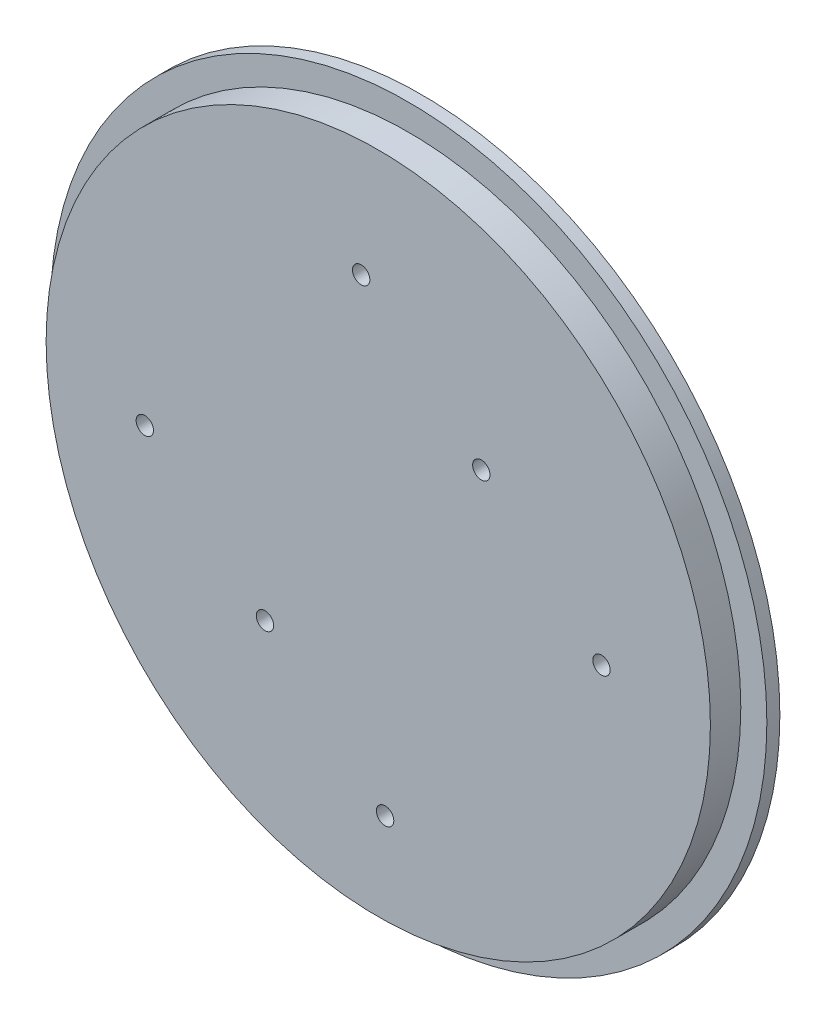
ISO-10303-21;
HEADER;
FILE_DESCRIPTION(('STEP AP214'),'2;1');
FILE_NAME('part.step','',(''),(''),'','','');
FILE_SCHEMA(('AUTOMOTIVE_DESIGN { 1 0 10303 214 1 1 1 1 }'));
ENDSEC;
DATA;
#1=APPLICATION_CONTEXT('core data for automotive mechanical design processes');
#2=APPLICATION_PROTOCOL_DEFINITION('international standard','automotive_design',2000,#1);
#3=PRODUCT_CONTEXT('',#1,'mechanical');
#4=PRODUCT('Part','Part','',(#3));
#5=PRODUCT_RELATED_PRODUCT_CATEGORY('part','',(#4));
#6=PRODUCT_DEFINITION_FORMATION('','',#4);
#7=PRODUCT_DEFINITION_CONTEXT('part definition',#1,'design');
#8=PRODUCT_DEFINITION('design','',#6,#7);
#9=PRODUCT_DEFINITION_SHAPE('','',#8);
#10=(LENGTH_UNIT() NAMED_UNIT(*) SI_UNIT(.MILLI.,.METRE.));
#11=(NAMED_UNIT(*) PLANE_ANGLE_UNIT() SI_UNIT($,.RADIAN.));
#12=(NAMED_UNIT(*) SI_UNIT($,.STERADIAN.) SOLID_ANGLE_UNIT());
#13=UNCERTAINTY_MEASURE_WITH_UNIT(LENGTH_MEASURE(1.E-05),#10,'distance_accuracy_value','');
#14=(GEOMETRIC_REPRESENTATION_CONTEXT(3) GLOBAL_UNCERTAINTY_ASSIGNED_CONTEXT((#13)) GLOBAL_UNIT_ASSIGNED_CONTEXT((#10,
#11,#12)) REPRESENTATION_CONTEXT('',''));
#15=CARTESIAN_POINT('',(0.,0.,0.));
#16=DIRECTION('',(0.,0.,1.));
#17=DIRECTION('',(1.,0.,0.));
#18=AXIS2_PLACEMENT_3D('',#15,#16,#17);
#19=CARTESIAN_POINT('',(-3.93578105345823,49.5924455360115,10.));
#20=DIRECTION('',(0.,0.,-1.));
#21=DIRECTION('',(-1.,0.,0.));
#22=AXIS2_PLACEMENT_3D('',#19,#20,#21);
#23=CYLINDRICAL_SURFACE('',#22,2.);
#24=CARTESIAN_POINT('',(-3.93578105345823,49.5924455360115,10.));
#25=DIRECTION('',(0.,0.,-1.));
#26=DIRECTION('',(-1.,0.,0.));
#27=AXIS2_PLACEMENT_3D('',#24,#25,#26);
#28=CIRCLE('',#27,2.);
#29=CARTESIAN_POINT('',(-5.93578105345822,49.5924455360115,10.));
#30=VERTEX_POINT('',#29);
#31=EDGE_CURVE('E128',#30,#30,#28,.T.);
#32=ORIENTED_EDGE('',*,*,#31,.F.);
#33=EDGE_LOOP('',(#32));
#34=FACE_BOUND('',#33,.T.);
#35=CARTESIAN_POINT('',(-3.93578105345823,49.5924455360115,5.));
#36=DIRECTION('',(0.,0.,-1.));
#37=DIRECTION('',(-1.,0.,0.));
#38=AXIS2_PLACEMENT_3D('',#35,#36,#37);
#39=CIRCLE('',#38,2.);
#40=CARTESIAN_POINT('',(-5.93578105345822,49.5924455360115,5.));
#41=VERTEX_POINT('',#40);
#42=EDGE_CURVE('E45',#41,#41,#39,.F.);
#43=ORIENTED_EDGE('',*,*,#42,.F.);
#44=EDGE_LOOP('',(#43));
#45=FACE_BOUND('',#44,.T.);
#46=ADVANCED_FACE('F41',(#34,#45),#23,.F.);
#47=CARTESIAN_POINT('',(23.7357315299309,24.5063958002057,10.));
#48=DIRECTION('',(0.,0.,-1.));
#49=DIRECTION('',(-1.,0.,0.));
#50=AXIS2_PLACEMENT_3D('',#47,#48,#49);
#51=CYLINDRICAL_SURFACE('',#50,2.);
#52=CARTESIAN_POINT('',(23.7357315299309,24.5063958002057,10.));
#53=DIRECTION('',(0.,0.,-1.));
#54=DIRECTION('',(-1.,0.,0.));
#55=AXIS2_PLACEMENT_3D('',#52,#53,#54);
#56=CIRCLE('',#55,2.);
#57=CARTESIAN_POINT('',(21.7357315299309,24.5063958002057,10.));
#58=VERTEX_POINT('',#57);
#59=EDGE_CURVE('E133',#58,#58,#56,.T.);
#60=ORIENTED_EDGE('',*,*,#59,.F.);
#61=EDGE_LOOP('',(#60));
#62=FACE_BOUND('',#61,.T.);
#63=CARTESIAN_POINT('',(23.7357315299309,24.5063958002057,5.));
#64=DIRECTION('',(0.,0.,-1.));
#65=DIRECTION('',(-1.,0.,0.));
#66=AXIS2_PLACEMENT_3D('',#63,#64,#65);
#67=CIRCLE('',#66,2.);
#68=CARTESIAN_POINT('',(21.7357315299309,24.5063958002057,5.));
#69=VERTEX_POINT('',#68);
#70=EDGE_CURVE('E121',#69,#69,#67,.F.);
#71=ORIENTED_EDGE('',*,*,#70,.F.);
#72=EDGE_LOOP('',(#71));
#73=FACE_BOUND('',#72,.T.);
#74=ADVANCED_FACE('F249',(#62,#73),#51,.F.);
#75=CARTESIAN_POINT('',(51.4072441133201,-0.579653935599934,10.));
#76=DIRECTION('',(0.,0.,-1.));
#77=DIRECTION('',(-1.,0.,0.));
#78=AXIS2_PLACEMENT_3D('',#75,#76,#77);
#79=CYLINDRICAL_SURFACE('',#78,2.);
#80=CARTESIAN_POINT('',(51.4072441133201,-0.579653935599934,10.));
#81=DIRECTION('',(0.,0.,-1.));
#82=DIRECTION('',(-1.,0.,0.));
#83=AXIS2_PLACEMENT_3D('',#80,#81,#82);
#84=CIRCLE('',#83,2.);
#85=CARTESIAN_POINT('',(49.4072441133201,-0.579653935599934,10.));
#86=VERTEX_POINT('',#85);
#87=EDGE_CURVE('E138',#86,#86,#84,.T.);
#88=ORIENTED_EDGE('',*,*,#87,.F.);
#89=EDGE_LOOP('',(#88));
#90=FACE_BOUND('',#89,.T.);
#91=CARTESIAN_POINT('',(51.4072441133201,-0.579653935599934,5.));
#92=DIRECTION('',(0.,0.,-1.));
#93=DIRECTION('',(-1.,0.,0.));
#94=AXIS2_PLACEMENT_3D('',#91,#92,#93);
#95=CIRCLE('',#94,2.);
#96=CARTESIAN_POINT('',(49.4072441133201,-0.579653935599934,5.));
#97=VERTEX_POINT('',#96);
#98=EDGE_CURVE('E118',#97,#97,#95,.F.);
#99=ORIENTED_EDGE('',*,*,#98,.F.);
#100=EDGE_LOOP('',(#99));
#101=FACE_BOUND('',#100,.T.);
#102=ADVANCED_FACE('F255',(#90,#101),#79,.F.);
#103=CARTESIAN_POINT('',(-53.7695311495795,-5.37735869324198,10.));
#104=DIRECTION('',(0.,0.,-1.));
#105=DIRECTION('',(-1.,0.,0.));
#106=AXIS2_PLACEMENT_3D('',#103,#104,#105);
#107=CYLINDRICAL_SURFACE('',#106,2.);
#108=CARTESIAN_POINT('',(-53.7695311495795,-5.37735869324198,10.));
#109=DIRECTION('',(0.,0.,-1.));
#110=DIRECTION('',(-1.,0.,0.));
#111=AXIS2_PLACEMENT_3D('',#108,#109,#110);
#112=CIRCLE('',#111,2.);
#113=CARTESIAN_POINT('',(-55.7695311495795,-5.37735869324198,10.));
#114=VERTEX_POINT('',#113);
#115=EDGE_CURVE('E144',#114,#114,#112,.T.);
#116=ORIENTED_EDGE('',*,*,#115,.F.);
#117=EDGE_LOOP('',(#116));
#118=FACE_BOUND('',#117,.T.);
#119=CARTESIAN_POINT('',(-53.7695311495795,-5.37735869324198,5.));
#120=DIRECTION('',(0.,0.,-1.));
#121=DIRECTION('',(-1.,0.,0.));
#122=AXIS2_PLACEMENT_3D('',#119,#120,#121);
#123=CIRCLE('',#122,2.);
#124=CARTESIAN_POINT('',(-55.7695311495795,-5.37735869324198,5.));
#125=VERTEX_POINT('',#124);
#126=EDGE_CURVE('E114',#125,#125,#123,.F.);
#127=ORIENTED_EDGE('',*,*,#126,.F.);
#128=EDGE_LOOP('',(#127));
#129=FACE_BOUND('',#128,.T.);
#130=ADVANCED_FACE('F318',(#118,#129),#107,.F.);
#131=CARTESIAN_POINT('',(-26.0980185661855,-30.4634084290424,10.));
#132=DIRECTION('',(0.,0.,-1.));
#133=DIRECTION('',(-1.,0.,0.));
#134=AXIS2_PLACEMENT_3D('',#131,#132,#133);
#135=CYLINDRICAL_SURFACE('',#134,2.);
#136=CARTESIAN_POINT('',(-26.0980185661855,-30.4634084290424,10.));
#137=DIRECTION('',(0.,0.,-1.));
#138=DIRECTION('',(-1.,0.,0.));
#139=AXIS2_PLACEMENT_3D('',#136,#137,#138);
#140=CIRCLE('',#139,2.);
#141=CARTESIAN_POINT('',(-28.0980185661855,-30.4634084290424,10.));
#142=VERTEX_POINT('',#141);
#143=EDGE_CURVE('E148',#142,#142,#140,.T.);
#144=ORIENTED_EDGE('',*,*,#143,.F.);
#145=EDGE_LOOP('',(#144));
#146=FACE_BOUND('',#145,.T.);
#147=CARTESIAN_POINT('',(-26.0980185661855,-30.4634084290424,5.));
#148=DIRECTION('',(0.,0.,-1.));
#149=DIRECTION('',(-1.,0.,0.));
#150=AXIS2_PLACEMENT_3D('',#147,#148,#149);
#151=CIRCLE('',#150,2.);
#152=CARTESIAN_POINT('',(-28.0980185661855,-30.4634084290424,5.));
#153=VERTEX_POINT('',#152);
#154=EDGE_CURVE('E109',#153,#153,#151,.F.);
#155=ORIENTED_EDGE('',*,*,#154,.F.);
#156=EDGE_LOOP('',(#155));
#157=FACE_BOUND('',#156,.T.);
#158=ADVANCED_FACE('F311',(#146,#157),#135,.F.);
#159=CARTESIAN_POINT('',(1.57349401720842,-55.5494581648429,10.));
#160=DIRECTION('',(0.,0.,-1.));
#161=DIRECTION('',(-1.,0.,0.));
#162=AXIS2_PLACEMENT_3D('',#159,#160,#161);
#163=CYLINDRICAL_SURFACE('',#162,2.);
#164=CARTESIAN_POINT('',(1.57349401720842,-55.5494581648429,10.));
#165=DIRECTION('',(0.,0.,-1.));
#166=DIRECTION('',(-1.,0.,0.));
#167=AXIS2_PLACEMENT_3D('',#164,#165,#166);
#168=CIRCLE('',#167,2.);
#169=CARTESIAN_POINT('',(-0.426505982791577,-55.5494581648429,10.));
#170=VERTEX_POINT('',#169);
#171=EDGE_CURVE('E152',#170,#170,#168,.T.);
#172=ORIENTED_EDGE('',*,*,#171,.F.);
#173=EDGE_LOOP('',(#172));
#174=FACE_BOUND('',#173,.T.);
#175=CARTESIAN_POINT('',(1.57349401720842,-55.5494581648429,5.));
#176=DIRECTION('',(0.,0.,-1.));
#177=DIRECTION('',(-1.,0.,0.));
#178=AXIS2_PLACEMENT_3D('',#175,#176,#177);
#179=CIRCLE('',#178,2.);
#180=CARTESIAN_POINT('',(-0.426505982791577,-55.5494581648429,5.));
#181=VERTEX_POINT('',#180);
#182=EDGE_CURVE('E105',#181,#181,#179,.F.);
#183=ORIENTED_EDGE('',*,*,#182,.F.);
#184=EDGE_LOOP('',(#183));
#185=FACE_BOUND('',#184,.T.);
#186=ADVANCED_FACE('F306',(#174,#185),#163,.F.);
#187=CARTESIAN_POINT('',(0.,0.,3.));
#188=DIRECTION('',(0.,0.,1.));
#189=DIRECTION('',(1.,0.,0.));
#190=AXIS2_PLACEMENT_3D('',#187,#188,#189);
#191=PLANE('',#190);
#192=CARTESIAN_POINT('',(0.,0.,3.));
#193=DIRECTION('',(0.,0.,1.));
#194=DIRECTION('',(1.,0.,0.));
#195=AXIS2_PLACEMENT_3D('',#192,#193,#194);
#196=CIRCLE('',#195,76.5);
#197=CARTESIAN_POINT('',(76.5,0.,3.));
#198=VERTEX_POINT('',#197);
#199=EDGE_CURVE('E10',#198,#198,#196,.T.);
#200=ORIENTED_EDGE('',*,*,#199,.F.);
#201=EDGE_LOOP('',(#200));
#202=FACE_BOUND('',#201,.T.);
#203=CARTESIAN_POINT('',(0.,0.,3.));
#204=DIRECTION('',(0.,0.,1.));
#205=DIRECTION('',(1.,0.,0.));
#206=AXIS2_PLACEMENT_3D('',#203,#204,#205);
#207=CIRCLE('',#206,82.5);
#208=CARTESIAN_POINT('',(82.5,0.,3.));
#209=VERTEX_POINT('',#208);
#210=EDGE_CURVE('E88',#209,#209,#207,.T.);
#211=ORIENTED_EDGE('',*,*,#210,.T.);
#212=EDGE_LOOP('',(#211));
#213=FACE_BOUND('',#212,.T.);
#214=ADVANCED_FACE('F217',(#202,#213),#191,.T.);
#215=CARTESIAN_POINT('',(0.,0.,0.));
#216=DIRECTION('',(0.,0.,1.));
#217=DIRECTION('',(1.,0.,0.));
#218=AXIS2_PLACEMENT_3D('',#215,#216,#217);
#219=PLANE('',#218);
#220=CARTESIAN_POINT('',(51.4072441133201,-0.579653935599934,0.));
#221=DIRECTION('',(0.,0.,-1.));
#222=DIRECTION('',(-1.,0.,0.));
#223=AXIS2_PLACEMENT_3D('',#220,#221,#222);
#224=CIRCLE('',#223,7.49999999999999);
#225=CARTESIAN_POINT('',(43.9072441133201,-0.579653935599934,0.));
#226=VERTEX_POINT('',#225);
#227=EDGE_CURVE('E196',#226,#226,#224,.T.);
#228=ORIENTED_EDGE('',*,*,#227,.F.);
#229=EDGE_LOOP('',(#228));
#230=FACE_BOUND('',#229,.T.);
#231=CARTESIAN_POINT('',(23.7357315299309,24.5063958002057,0.));
#232=DIRECTION('',(0.,0.,-1.));
#233=DIRECTION('',(-1.,0.,0.));
#234=AXIS2_PLACEMENT_3D('',#231,#232,#233);
#235=CIRCLE('',#234,7.5);
#236=CARTESIAN_POINT('',(16.2357315299309,24.5063958002057,0.));
#237=VERTEX_POINT('',#236);
#238=EDGE_CURVE('E192',#237,#237,#235,.T.);
#239=ORIENTED_EDGE('',*,*,#238,.F.);
#240=EDGE_LOOP('',(#239));
#241=FACE_BOUND('',#240,.T.);
#242=CARTESIAN_POINT('',(-3.93578105345823,49.5924455360115,0.));
#243=DIRECTION('',(0.,0.,-1.));
#244=DIRECTION('',(-1.,0.,0.));
#245=AXIS2_PLACEMENT_3D('',#242,#243,#244);
#246=CIRCLE('',#245,7.5);
#247=CARTESIAN_POINT('',(-11.4357810534582,49.5924455360115,0.));
#248=VERTEX_POINT('',#247);
#249=EDGE_CURVE('E184',#248,#248,#246,.T.);
#250=ORIENTED_EDGE('',*,*,#249,.F.);
#251=EDGE_LOOP('',(#250));
#252=FACE_BOUND('',#251,.T.);
#253=CARTESIAN_POINT('',(-53.7695311495795,-5.37735869324198,0.));
#254=DIRECTION('',(0.,0.,-1.));
#255=DIRECTION('',(-1.,0.,0.));
#256=AXIS2_PLACEMENT_3D('',#253,#254,#255);
#257=CIRCLE('',#256,7.49999999999999);
#258=CARTESIAN_POINT('',(-61.2695311495795,-5.37735869324198,0.));
#259=VERTEX_POINT('',#258);
#260=EDGE_CURVE('E176',#259,#259,#257,.T.);
#261=ORIENTED_EDGE('',*,*,#260,.F.);
#262=EDGE_LOOP('',(#261));
#263=FACE_BOUND('',#262,.T.);
#264=CARTESIAN_POINT('',(-26.0980185661855,-30.4634084290424,0.));
#265=DIRECTION('',(0.,0.,-1.));
#266=DIRECTION('',(-1.,0.,0.));
#267=AXIS2_PLACEMENT_3D('',#264,#265,#266);
#268=CIRCLE('',#267,7.49999999999999);
#269=CARTESIAN_POINT('',(-33.5980185661855,-30.4634084290424,0.));
#270=VERTEX_POINT('',#269);
#271=EDGE_CURVE('E168',#270,#270,#268,.T.);
#272=ORIENTED_EDGE('',*,*,#271,.F.);
#273=EDGE_LOOP('',(#272));
#274=FACE_BOUND('',#273,.T.);
#275=CARTESIAN_POINT('',(1.57349401720842,-55.5494581648429,0.));
#276=DIRECTION('',(0.,0.,-1.));
#277=DIRECTION('',(-1.,0.,0.));
#278=AXIS2_PLACEMENT_3D('',#275,#276,#277);
#279=CIRCLE('',#278,7.5);
#280=CARTESIAN_POINT('',(-5.92650598279158,-55.5494581648429,0.));
#281=VERTEX_POINT('',#280);
#282=EDGE_CURVE('E160',#281,#281,#279,.T.);
#283=ORIENTED_EDGE('',*,*,#282,.F.);
#284=EDGE_LOOP('',(#283));
#285=FACE_BOUND('',#284,.T.);
#286=CARTESIAN_POINT('',(0.,0.,0.));
#287=DIRECTION('',(0.,0.,1.));
#288=DIRECTION('',(1.,0.,0.));
#289=AXIS2_PLACEMENT_3D('',#286,#287,#288);
#290=CIRCLE('',#289,10.);
#291=CARTESIAN_POINT('',(10.,0.,0.));
#292=VERTEX_POINT('',#291);
#293=EDGE_CURVE('E74',#292,#292,#290,.T.);
#294=ORIENTED_EDGE('',*,*,#293,.T.);
#295=EDGE_LOOP('',(#294));
#296=FACE_BOUND('',#295,.T.);
#297=CARTESIAN_POINT('',(-15.120762885547,-54.9578250093568,0.));
#298=DIRECTION('',(0.,0.,1.));
#299=DIRECTION('',(1.,0.,0.));
#300=AXIS2_PLACEMENT_3D('',#297,#298,#299);
#301=CIRCLE('',#300,5.925);
#302=CARTESIAN_POINT('',(-9.19576288554697,-54.9578250093568,0.));
#303=VERTEX_POINT('',#302);
#304=EDGE_CURVE('E50',#303,#303,#301,.F.);
#305=ORIENTED_EDGE('',*,*,#304,.F.);
#306=EDGE_LOOP('',(#305));
#307=FACE_BOUND('',#306,.T.);
#308=CARTESIAN_POINT('',(-40.0344911520696,40.5738772881626,0.));
#309=DIRECTION('',(0.,0.,1.));
#310=DIRECTION('',(1.,0.,0.));
#311=AXIS2_PLACEMENT_3D('',#308,#309,#310);
#312=CIRCLE('',#311,5.925);
#313=CARTESIAN_POINT('',(-34.1094911520696,40.5738772881626,0.));
#314=VERTEX_POINT('',#313);
#315=EDGE_CURVE('E56',#314,#314,#312,.F.);
#316=ORIENTED_EDGE('',*,*,#315,.F.);
#317=EDGE_LOOP('',(#316));
#318=FACE_BOUND('',#317,.T.);
#319=CARTESIAN_POINT('',(55.1552540376161,14.3839477211941,0.));
#320=DIRECTION('',(0.,0.,1.));
#321=DIRECTION('',(1.,0.,0.));
#322=AXIS2_PLACEMENT_3D('',#319,#320,#321);
#323=CIRCLE('',#322,5.925);
#324=CARTESIAN_POINT('',(61.0802540376161,14.3839477211941,0.));
#325=VERTEX_POINT('',#324);
#326=EDGE_CURVE('E92',#325,#325,#323,.F.);
#327=ORIENTED_EDGE('',*,*,#326,.F.);
#328=EDGE_LOOP('',(#327));
#329=FACE_BOUND('',#328,.T.);
#330=CARTESIAN_POINT('',(0.,0.,0.));
#331=DIRECTION('',(0.,0.,1.));
#332=DIRECTION('',(1.,0.,0.));
#333=AXIS2_PLACEMENT_3D('',#330,#331,#332);
#334=CIRCLE('',#333,82.5);
#335=CARTESIAN_POINT('',(82.5,0.,0.));
#336=VERTEX_POINT('',#335);
#337=EDGE_CURVE('E87',#336,#336,#334,.T.);
#338=ORIENTED_EDGE('',*,*,#337,.F.);
#339=EDGE_LOOP('',(#338));
#340=FACE_BOUND('',#339,.T.);
#341=ADVANCED_FACE('F214',(#230,#241,#252,#263,#274,#285,#296,#307,#318,#329,#340),#219,.F.);
#342=CARTESIAN_POINT('',(0.,0.,3.));
#343=DIRECTION('',(0.,0.,-1.));
#344=DIRECTION('',(-1.,0.,0.));
#345=AXIS2_PLACEMENT_3D('',#342,#343,#344);
#346=CYLINDRICAL_SURFACE('',#345,82.5);
#347=ORIENTED_EDGE('',*,*,#210,.F.);
#348=EDGE_LOOP('',(#347));
#349=FACE_BOUND('',#348,.T.);
#350=ORIENTED_EDGE('',*,*,#337,.T.);
#351=EDGE_LOOP('',(#350));
#352=FACE_BOUND('',#351,.T.);
#353=ADVANCED_FACE('F43',(#349,#352),#346,.T.);
#354=CARTESIAN_POINT('',(55.1552540376161,14.3839477211941,-8.));
#355=DIRECTION('',(0.,0.,1.));
#356=DIRECTION('',(1.,0.,0.));
#357=AXIS2_PLACEMENT_3D('',#354,#355,#356);
#358=CYLINDRICAL_SURFACE('',#357,5.925);
#359=CARTESIAN_POINT('',(55.1552540376161,14.3839477211941,-8.));
#360=DIRECTION('',(0.,0.,-1.));
#361=DIRECTION('',(-1.,0.,0.));
#362=AXIS2_PLACEMENT_3D('',#359,#360,#361);
#363=CIRCLE('',#362,5.925);
#364=CARTESIAN_POINT('',(49.2302540376161,14.3839477211941,-8.));
#365=VERTEX_POINT('',#364);
#366=EDGE_CURVE('E83',#365,#365,#363,.T.);
#367=ORIENTED_EDGE('',*,*,#366,.F.);
#368=EDGE_LOOP('',(#367));
#369=FACE_BOUND('',#368,.T.);
#370=ORIENTED_EDGE('',*,*,#326,.T.);
#371=EDGE_LOOP('',(#370));
#372=FACE_BOUND('',#371,.T.);
#373=ADVANCED_FACE('F239',(#369,#372),#358,.T.);
#374=CARTESIAN_POINT('',(55.1552540376161,14.3839477211941,-8.));
#375=DIRECTION('',(0.,0.,-1.));
#376=DIRECTION('',(-1.,0.,0.));
#377=AXIS2_PLACEMENT_3D('',#374,#375,#376);
#378=PLANE('',#377);
#379=ORIENTED_EDGE('',*,*,#366,.T.);
#380=EDGE_LOOP('',(#379));
#381=FACE_BOUND('',#380,.T.);
#382=ADVANCED_FACE('F244',(#381),#378,.T.);
#383=CARTESIAN_POINT('',(-40.0344911520696,40.5738772881626,-8.));
#384=DIRECTION('',(0.,0.,1.));
#385=DIRECTION('',(1.,0.,0.));
#386=AXIS2_PLACEMENT_3D('',#383,#384,#385);
#387=CYLINDRICAL_SURFACE('',#386,5.925);
#388=CARTESIAN_POINT('',(-40.0344911520696,40.5738772881626,-8.));
#389=DIRECTION('',(0.,0.,-1.));
#390=DIRECTION('',(-1.,0.,0.));
#391=AXIS2_PLACEMENT_3D('',#388,#389,#390);
#392=CIRCLE('',#391,5.925);
#393=CARTESIAN_POINT('',(-45.9594911520696,40.5738772881626,-8.));
#394=VERTEX_POINT('',#393);
#395=EDGE_CURVE('E79',#394,#394,#392,.T.);
#396=ORIENTED_EDGE('',*,*,#395,.F.);
#397=EDGE_LOOP('',(#396));
#398=FACE_BOUND('',#397,.T.);
#399=ORIENTED_EDGE('',*,*,#315,.T.);
#400=EDGE_LOOP('',(#399));
#401=FACE_BOUND('',#400,.T.);
#402=ADVANCED_FACE('F295',(#398,#401),#387,.T.);
#403=CARTESIAN_POINT('',(-40.0344911520696,40.5738772881626,-8.));
#404=DIRECTION('',(0.,0.,-1.));
#405=DIRECTION('',(-1.,0.,0.));
#406=AXIS2_PLACEMENT_3D('',#403,#404,#405);
#407=PLANE('',#406);
#408=ORIENTED_EDGE('',*,*,#395,.T.);
#409=EDGE_LOOP('',(#408));
#410=FACE_BOUND('',#409,.T.);
#411=ADVANCED_FACE('F290',(#410),#407,.T.);
#412=CARTESIAN_POINT('',(-15.120762885547,-54.9578250093568,-8.));
#413=DIRECTION('',(0.,0.,1.));
#414=DIRECTION('',(1.,0.,0.));
#415=AXIS2_PLACEMENT_3D('',#412,#413,#414);
#416=CYLINDRICAL_SURFACE('',#415,5.925);
#417=CARTESIAN_POINT('',(-15.120762885547,-54.9578250093568,-8.));
#418=DIRECTION('',(0.,0.,-1.));
#419=DIRECTION('',(-1.,0.,0.));
#420=AXIS2_PLACEMENT_3D('',#417,#418,#419);
#421=CIRCLE('',#420,5.925);
#422=CARTESIAN_POINT('',(-21.045762885547,-54.9578250093568,-8.));
#423=VERTEX_POINT('',#422);
#424=EDGE_CURVE('E75',#423,#423,#421,.T.);
#425=ORIENTED_EDGE('',*,*,#424,.F.);
#426=EDGE_LOOP('',(#425));
#427=FACE_BOUND('',#426,.T.);
#428=ORIENTED_EDGE('',*,*,#304,.T.);
#429=EDGE_LOOP('',(#428));
#430=FACE_BOUND('',#429,.T.);
#431=ADVANCED_FACE('F287',(#427,#430),#416,.T.);
#432=CARTESIAN_POINT('',(-15.120762885547,-54.9578250093568,-8.));
#433=DIRECTION('',(0.,0.,-1.));
#434=DIRECTION('',(-1.,0.,0.));
#435=AXIS2_PLACEMENT_3D('',#432,#433,#434);
#436=PLANE('',#435);
#437=ORIENTED_EDGE('',*,*,#424,.T.);
#438=EDGE_LOOP('',(#437));
#439=FACE_BOUND('',#438,.T.);
#440=ADVANCED_FACE('F282',(#439),#436,.T.);
#441=CARTESIAN_POINT('',(0.,0.,-36.2842712474619));
#442=DIRECTION('',(0.,0.,1.));
#443=DIRECTION('',(1.,0.,0.));
#444=AXIS2_PLACEMENT_3D('',#441,#442,#443);
#445=CYLINDRICAL_SURFACE('',#444,10.);
#446=CARTESIAN_POINT('',(0.,0.,-8.));
#447=DIRECTION('',(0.,0.,-1.));
#448=DIRECTION('',(-1.,0.,0.));
#449=AXIS2_PLACEMENT_3D('',#446,#447,#448);
#450=CIRCLE('',#449,10.);
#451=CARTESIAN_POINT('',(-10.,0.,-8.));
#452=VERTEX_POINT('',#451);
#453=EDGE_CURVE('E66',#452,#452,#450,.F.);
#454=ORIENTED_EDGE('',*,*,#453,.T.);
#455=EDGE_LOOP('',(#454));
#456=FACE_BOUND('',#455,.T.);
#457=ORIENTED_EDGE('',*,*,#293,.F.);
#458=EDGE_LOOP('',(#457));
#459=FACE_BOUND('',#458,.T.);
#460=ADVANCED_FACE('F279',(#456,#459),#445,.T.);
#461=CARTESIAN_POINT('',(55.1552540376161,14.3839477211941,-8.));
#462=DIRECTION('',(0.,0.,-1.));
#463=DIRECTION('',(-1.,0.,0.));
#464=AXIS2_PLACEMENT_3D('',#461,#462,#463);
#465=PLANE('',#464);
#466=CARTESIAN_POINT('',(0.,0.,-8.));
#467=DIRECTION('',(0.,0.,-1.));
#468=DIRECTION('',(-1.,0.,0.));
#469=AXIS2_PLACEMENT_3D('',#466,#467,#468);
#470=CIRCLE('',#469,3.05);
#471=CARTESIAN_POINT('',(-3.05,0.,-8.));
#472=VERTEX_POINT('',#471);
#473=EDGE_CURVE('E67',#472,#472,#470,.T.);
#474=ORIENTED_EDGE('',*,*,#473,.F.);
#475=EDGE_LOOP('',(#474));
#476=FACE_BOUND('',#475,.T.);
#477=ORIENTED_EDGE('',*,*,#453,.F.);
#478=EDGE_LOOP('',(#477));
#479=FACE_BOUND('',#478,.T.);
#480=ADVANCED_FACE('F277',(#476,#479),#465,.T.);
#481=CARTESIAN_POINT('',(0.,0.,-7.));
#482=DIRECTION('',(0.,0.,-1.));
#483=DIRECTION('',(-1.,0.,0.));
#484=AXIS2_PLACEMENT_3D('',#481,#482,#483);
#485=CYLINDRICAL_SURFACE('',#484,3.05);
#486=CARTESIAN_POINT('',(0.,0.,-7.));
#487=DIRECTION('',(0.,0.,-1.));
#488=DIRECTION('',(-1.,0.,0.));
#489=AXIS2_PLACEMENT_3D('',#486,#487,#488);
#490=CIRCLE('',#489,3.05);
#491=CARTESIAN_POINT('',(-3.05,0.,-7.));
#492=VERTEX_POINT('',#491);
#493=EDGE_CURVE('E62',#492,#492,#490,.T.);
#494=ORIENTED_EDGE('',*,*,#493,.F.);
#495=EDGE_LOOP('',(#494));
#496=FACE_BOUND('',#495,.T.);
#497=ORIENTED_EDGE('',*,*,#473,.T.);
#498=EDGE_LOOP('',(#497));
#499=FACE_BOUND('',#498,.T.);
#500=ADVANCED_FACE('F273',(#496,#499),#485,.F.);
#501=CARTESIAN_POINT('',(0.,0.,-7.));
#502=DIRECTION('',(0.,0.,-1.));
#503=DIRECTION('',(-1.,0.,0.));
#504=AXIS2_PLACEMENT_3D('',#501,#502,#503);
#505=PLANE('',#504);
#506=ORIENTED_EDGE('',*,*,#493,.T.);
#507=EDGE_LOOP('',(#506));
#508=FACE_BOUND('',#507,.T.);
#509=ADVANCED_FACE('F269',(#508),#505,.T.);
#510=CARTESIAN_POINT('',(0.,0.,10.));
#511=DIRECTION('',(0.,0.,-1.));
#512=DIRECTION('',(-1.,0.,0.));
#513=AXIS2_PLACEMENT_3D('',#510,#511,#512);
#514=CYLINDRICAL_SURFACE('',#513,76.5);
#515=CARTESIAN_POINT('',(0.,0.,10.));
#516=DIRECTION('',(0.,0.,1.));
#517=DIRECTION('',(1.,0.,0.));
#518=AXIS2_PLACEMENT_3D('',#515,#516,#517);
#519=CIRCLE('',#518,76.5);
#520=CARTESIAN_POINT('',(76.5,0.,10.));
#521=VERTEX_POINT('',#520);
#522=EDGE_CURVE('E60',#521,#521,#519,.T.);
#523=ORIENTED_EDGE('',*,*,#522,.F.);
#524=EDGE_LOOP('',(#523));
#525=FACE_BOUND('',#524,.T.);
#526=ORIENTED_EDGE('',*,*,#199,.T.);
#527=EDGE_LOOP('',(#526));
#528=FACE_BOUND('',#527,.T.);
#529=ADVANCED_FACE('F265',(#525,#528),#514,.T.);
#530=CARTESIAN_POINT('',(0.,0.,10.));
#531=DIRECTION('',(0.,0.,1.));
#532=DIRECTION('',(1.,0.,0.));
#533=AXIS2_PLACEMENT_3D('',#530,#531,#532);
#534=PLANE('',#533);
#535=ORIENTED_EDGE('',*,*,#171,.T.);
#536=EDGE_LOOP('',(#535));
#537=FACE_BOUND('',#536,.T.);
#538=ORIENTED_EDGE('',*,*,#143,.T.);
#539=EDGE_LOOP('',(#538));
#540=FACE_BOUND('',#539,.T.);
#541=ORIENTED_EDGE('',*,*,#115,.T.);
#542=EDGE_LOOP('',(#541));
#543=FACE_BOUND('',#542,.T.);
#544=ORIENTED_EDGE('',*,*,#87,.T.);
#545=EDGE_LOOP('',(#544));
#546=FACE_BOUND('',#545,.T.);
#547=ORIENTED_EDGE('',*,*,#59,.T.);
#548=EDGE_LOOP('',(#547));
#549=FACE_BOUND('',#548,.T.);
#550=ORIENTED_EDGE('',*,*,#31,.T.);
#551=EDGE_LOOP('',(#550));
#552=FACE_BOUND('',#551,.T.);
#553=ORIENTED_EDGE('',*,*,#522,.T.);
#554=EDGE_LOOP('',(#553));
#555=FACE_BOUND('',#554,.T.);
#556=ADVANCED_FACE('F261',(#537,#540,#543,#546,#549,#552,#555),#534,.T.);
#557=CARTESIAN_POINT('',(1.57349401720842,-55.5494581648429,5.));
#558=DIRECTION('',(0.,0.,-1.));
#559=DIRECTION('',(-1.,0.,0.));
#560=AXIS2_PLACEMENT_3D('',#557,#558,#559);
#561=PLANE('',#560);
#562=CARTESIAN_POINT('',(1.57349401720842,-55.5494581648429,5.));
#563=DIRECTION('',(0.,0.,-1.));
#564=DIRECTION('',(-1.,0.,0.));
#565=AXIS2_PLACEMENT_3D('',#562,#563,#564);
#566=CIRCLE('',#565,7.5);
#567=CARTESIAN_POINT('',(-5.92650598279158,-55.5494581648429,5.));
#568=VERTEX_POINT('',#567);
#569=EDGE_CURVE('E156',#568,#568,#566,.T.);
#570=ORIENTED_EDGE('',*,*,#569,.T.);
#571=EDGE_LOOP('',(#570));
#572=FACE_BOUND('',#571,.T.);
#573=ORIENTED_EDGE('',*,*,#182,.T.);
#574=EDGE_LOOP('',(#573));
#575=FACE_BOUND('',#574,.T.);
#576=ADVANCED_FACE('F264',(#572,#575),#561,.T.);
#577=CARTESIAN_POINT('',(1.57349401720842,-55.5494581648429,5.));
#578=DIRECTION('',(0.,0.,-1.));
#579=DIRECTION('',(-1.,0.,0.));
#580=AXIS2_PLACEMENT_3D('',#577,#578,#579);
#581=CYLINDRICAL_SURFACE('',#580,7.5);
#582=ORIENTED_EDGE('',*,*,#569,.F.);
#583=EDGE_LOOP('',(#582));
#584=FACE_BOUND('',#583,.T.);
#585=ORIENTED_EDGE('',*,*,#282,.T.);
#586=EDGE_LOOP('',(#585));
#587=FACE_BOUND('',#586,.T.);
#588=ADVANCED_FACE('F369',(#584,#587),#581,.F.);
#589=CARTESIAN_POINT('',(-26.0980185661855,-30.4634084290424,5.));
#590=DIRECTION('',(0.,0.,-1.));
#591=DIRECTION('',(-1.,0.,0.));
#592=AXIS2_PLACEMENT_3D('',#589,#590,#591);
#593=PLANE('',#592);
#594=CARTESIAN_POINT('',(-26.0980185661855,-30.4634084290424,5.));
#595=DIRECTION('',(0.,0.,-1.));
#596=DIRECTION('',(-1.,0.,0.));
#597=AXIS2_PLACEMENT_3D('',#594,#595,#596);
#598=CIRCLE('',#597,7.49999999999999);
#599=CARTESIAN_POINT('',(-33.5980185661855,-30.4634084290424,5.));
#600=VERTEX_POINT('',#599);
#601=EDGE_CURVE('E164',#600,#600,#598,.T.);
#602=ORIENTED_EDGE('',*,*,#601,.T.);
#603=EDGE_LOOP('',(#602));
#604=FACE_BOUND('',#603,.T.);
#605=ORIENTED_EDGE('',*,*,#154,.T.);
#606=EDGE_LOOP('',(#605));
#607=FACE_BOUND('',#606,.T.);
#608=ADVANCED_FACE('F366',(#604,#607),#593,.T.);
#609=CARTESIAN_POINT('',(-26.0980185661855,-30.4634084290424,5.));
#610=DIRECTION('',(0.,0.,-1.));
#611=DIRECTION('',(-1.,0.,0.));
#612=AXIS2_PLACEMENT_3D('',#609,#610,#611);
#613=CYLINDRICAL_SURFACE('',#612,7.49999999999999);
#614=ORIENTED_EDGE('',*,*,#601,.F.);
#615=EDGE_LOOP('',(#614));
#616=FACE_BOUND('',#615,.T.);
#617=ORIENTED_EDGE('',*,*,#271,.T.);
#618=EDGE_LOOP('',(#617));
#619=FACE_BOUND('',#618,.T.);
#620=ADVANCED_FACE('F362',(#616,#619),#613,.F.);
#621=CARTESIAN_POINT('',(-53.7695311495795,-5.37735869324198,5.));
#622=DIRECTION('',(0.,0.,-1.));
#623=DIRECTION('',(-1.,0.,0.));
#624=AXIS2_PLACEMENT_3D('',#621,#622,#623);
#625=PLANE('',#624);
#626=CARTESIAN_POINT('',(-53.7695311495795,-5.37735869324198,5.));
#627=DIRECTION('',(0.,0.,-1.));
#628=DIRECTION('',(-1.,0.,0.));
#629=AXIS2_PLACEMENT_3D('',#626,#627,#628);
#630=CIRCLE('',#629,7.49999999999999);
#631=CARTESIAN_POINT('',(-61.2695311495795,-5.37735869324198,5.));
#632=VERTEX_POINT('',#631);
#633=EDGE_CURVE('E172',#632,#632,#630,.T.);
#634=ORIENTED_EDGE('',*,*,#633,.T.);
#635=EDGE_LOOP('',(#634));
#636=FACE_BOUND('',#635,.T.);
#637=ORIENTED_EDGE('',*,*,#126,.T.);
#638=EDGE_LOOP('',(#637));
#639=FACE_BOUND('',#638,.T.);
#640=ADVANCED_FACE('F341',(#636,#639),#625,.T.);
#641=CARTESIAN_POINT('',(-53.7695311495795,-5.37735869324198,5.));
#642=DIRECTION('',(0.,0.,-1.));
#643=DIRECTION('',(-1.,0.,0.));
#644=AXIS2_PLACEMENT_3D('',#641,#642,#643);
#645=CYLINDRICAL_SURFACE('',#644,7.49999999999999);
#646=ORIENTED_EDGE('',*,*,#633,.F.);
#647=EDGE_LOOP('',(#646));
#648=FACE_BOUND('',#647,.T.);
#649=ORIENTED_EDGE('',*,*,#260,.T.);
#650=EDGE_LOOP('',(#649));
#651=FACE_BOUND('',#650,.T.);
#652=ADVANCED_FACE('F336',(#648,#651),#645,.F.);
#653=CARTESIAN_POINT('',(51.4072441133201,-0.579653935599934,5.));
#654=DIRECTION('',(0.,0.,-1.));
#655=DIRECTION('',(-1.,0.,0.));
#656=AXIS2_PLACEMENT_3D('',#653,#654,#655);
#657=PLANE('',#656);
#658=CARTESIAN_POINT('',(51.4072441133201,-0.579653935599934,5.));
#659=DIRECTION('',(0.,0.,-1.));
#660=DIRECTION('',(-1.,0.,0.));
#661=AXIS2_PLACEMENT_3D('',#658,#659,#660);
#662=CIRCLE('',#661,7.49999999999999);
#663=CARTESIAN_POINT('',(43.9072441133201,-0.579653935599934,5.));
#664=VERTEX_POINT('',#663);
#665=EDGE_CURVE('E110',#664,#664,#662,.T.);
#666=ORIENTED_EDGE('',*,*,#665,.T.);
#667=EDGE_LOOP('',(#666));
#668=FACE_BOUND('',#667,.T.);
#669=ORIENTED_EDGE('',*,*,#98,.T.);
#670=EDGE_LOOP('',(#669));
#671=FACE_BOUND('',#670,.T.);
#672=ADVANCED_FACE('F204',(#668,#671),#657,.T.);
#673=CARTESIAN_POINT('',(51.4072441133201,-0.579653935599934,5.));
#674=DIRECTION('',(0.,0.,-1.));
#675=DIRECTION('',(-1.,0.,0.));
#676=AXIS2_PLACEMENT_3D('',#673,#674,#675);
#677=CYLINDRICAL_SURFACE('',#676,7.49999999999999);
#678=ORIENTED_EDGE('',*,*,#665,.F.);
#679=EDGE_LOOP('',(#678));
#680=FACE_BOUND('',#679,.T.);
#681=ORIENTED_EDGE('',*,*,#227,.T.);
#682=EDGE_LOOP('',(#681));
#683=FACE_BOUND('',#682,.T.);
#684=ADVANCED_FACE('F207',(#680,#683),#677,.F.);
#685=CARTESIAN_POINT('',(23.7357315299309,24.5063958002057,5.));
#686=DIRECTION('',(0.,0.,-1.));
#687=DIRECTION('',(-1.,0.,0.));
#688=AXIS2_PLACEMENT_3D('',#685,#686,#687);
#689=PLANE('',#688);
#690=CARTESIAN_POINT('',(23.7357315299309,24.5063958002057,5.));
#691=DIRECTION('',(0.,0.,-1.));
#692=DIRECTION('',(-1.,0.,0.));
#693=AXIS2_PLACEMENT_3D('',#690,#691,#692);
#694=CIRCLE('',#693,7.5);
#695=CARTESIAN_POINT('',(16.2357315299309,24.5063958002057,5.));
#696=VERTEX_POINT('',#695);
#697=EDGE_CURVE('E188',#696,#696,#694,.T.);
#698=ORIENTED_EDGE('',*,*,#697,.T.);
#699=EDGE_LOOP('',(#698));
#700=FACE_BOUND('',#699,.T.);
#701=ORIENTED_EDGE('',*,*,#70,.T.);
#702=EDGE_LOOP('',(#701));
#703=FACE_BOUND('',#702,.T.);
#704=ADVANCED_FACE('F210',(#700,#703),#689,.T.);
#705=CARTESIAN_POINT('',(23.7357315299309,24.5063958002057,5.));
#706=DIRECTION('',(0.,0.,-1.));
#707=DIRECTION('',(-1.,0.,0.));
#708=AXIS2_PLACEMENT_3D('',#705,#706,#707);
#709=CYLINDRICAL_SURFACE('',#708,7.5);
#710=ORIENTED_EDGE('',*,*,#697,.F.);
#711=EDGE_LOOP('',(#710));
#712=FACE_BOUND('',#711,.T.);
#713=ORIENTED_EDGE('',*,*,#238,.T.);
#714=EDGE_LOOP('',(#713));
#715=FACE_BOUND('',#714,.T.);
#716=ADVANCED_FACE('F345',(#712,#715),#709,.F.);
#717=CARTESIAN_POINT('',(-3.93578105345823,49.5924455360115,5.));
#718=DIRECTION('',(0.,0.,-1.));
#719=DIRECTION('',(-1.,0.,0.));
#720=AXIS2_PLACEMENT_3D('',#717,#718,#719);
#721=PLANE('',#720);
#722=CARTESIAN_POINT('',(-3.93578105345823,49.5924455360115,5.));
#723=DIRECTION('',(0.,0.,-1.));
#724=DIRECTION('',(-1.,0.,0.));
#725=AXIS2_PLACEMENT_3D('',#722,#723,#724);
#726=CIRCLE('',#725,7.5);
#727=CARTESIAN_POINT('',(-11.4357810534582,49.5924455360115,5.));
#728=VERTEX_POINT('',#727);
#729=EDGE_CURVE('E180',#728,#728,#726,.T.);
#730=ORIENTED_EDGE('',*,*,#729,.T.);
#731=EDGE_LOOP('',(#730));
#732=FACE_BOUND('',#731,.T.);
#733=ORIENTED_EDGE('',*,*,#42,.T.);
#734=EDGE_LOOP('',(#733));
#735=FACE_BOUND('',#734,.T.);
#736=ADVANCED_FACE('F348',(#732,#735),#721,.T.);
#737=CARTESIAN_POINT('',(-3.93578105345823,49.5924455360115,5.));
#738=DIRECTION('',(0.,0.,-1.));
#739=DIRECTION('',(-1.,0.,0.));
#740=AXIS2_PLACEMENT_3D('',#737,#738,#739);
#741=CYLINDRICAL_SURFACE('',#740,7.5);
#742=ORIENTED_EDGE('',*,*,#729,.F.);
#743=EDGE_LOOP('',(#742));
#744=FACE_BOUND('',#743,.T.);
#745=ORIENTED_EDGE('',*,*,#249,.T.);
#746=EDGE_LOOP('',(#745));
#747=FACE_BOUND('',#746,.T.);
#748=ADVANCED_FACE('F353',(#744,#747),#741,.F.);
#749=CLOSED_SHELL('',(#46,#74,#102,#130,#158,#186,#214,#341,#353,#373,#382,#402,#411,#431,#440,
#460,#480,#500,#509,#529,#556,#576,#588,#608,#620,#640,#652,#672,#684,#704,#716,#736,#748));
#750=MANIFOLD_SOLID_BREP('B2',#749);
#751=ADVANCED_BREP_SHAPE_REPRESENTATION('',(#18,#750),#14);
#752=SHAPE_DEFINITION_REPRESENTATION(#9,#751);
ENDSEC;
END-ISO-10303-21;
